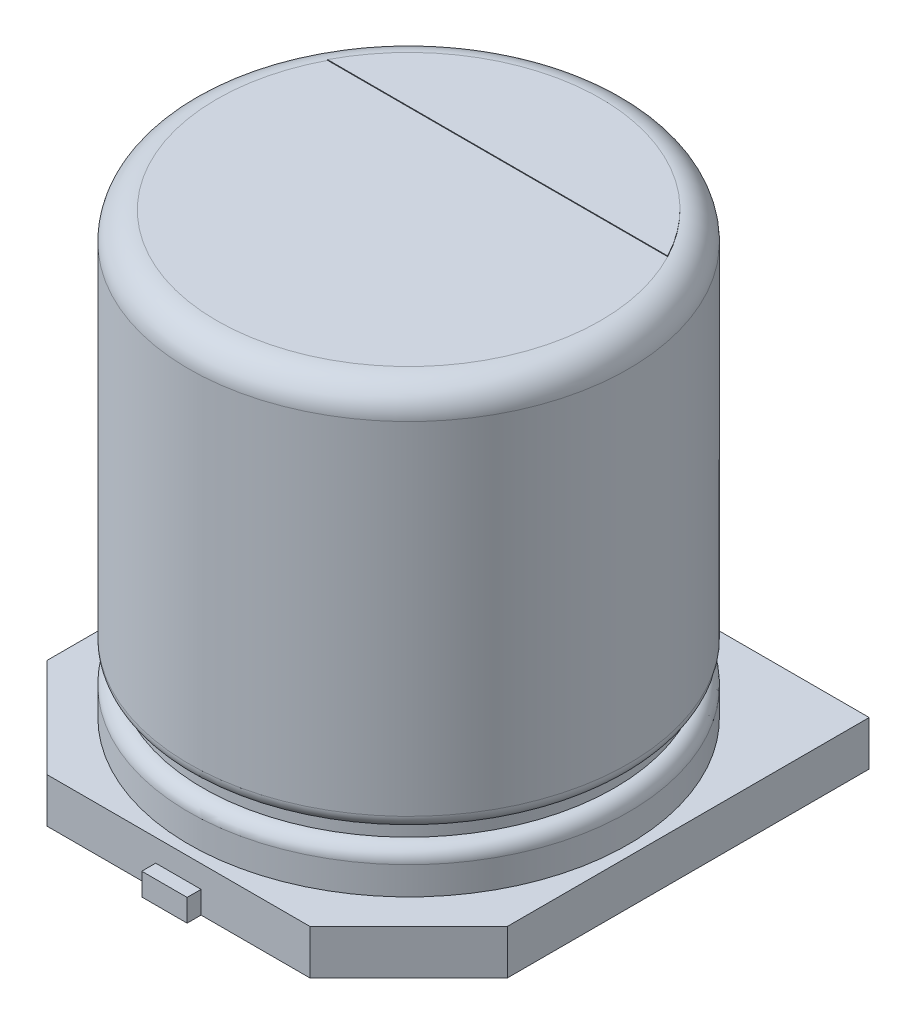
ISO-10303-21;
HEADER;
FILE_DESCRIPTION(('STEP AP214'),'2;1');
FILE_NAME('part.step','',(''),(''),'','','');
FILE_SCHEMA(('AUTOMOTIVE_DESIGN { 1 0 10303 214 1 1 1 1 }'));
ENDSEC;
DATA;
#1=APPLICATION_CONTEXT('core data for automotive mechanical design processes');
#2=APPLICATION_PROTOCOL_DEFINITION('international standard','automotive_design',2000,#1);
#3=PRODUCT_CONTEXT('',#1,'mechanical');
#4=PRODUCT('Part','Part','',(#3));
#5=PRODUCT_RELATED_PRODUCT_CATEGORY('part','',(#4));
#6=PRODUCT_DEFINITION_FORMATION('','',#4);
#7=PRODUCT_DEFINITION_CONTEXT('part definition',#1,'design');
#8=PRODUCT_DEFINITION('design','',#6,#7);
#9=PRODUCT_DEFINITION_SHAPE('','',#8);
#10=(LENGTH_UNIT() NAMED_UNIT(*) SI_UNIT(.MILLI.,.METRE.));
#11=(NAMED_UNIT(*) PLANE_ANGLE_UNIT() SI_UNIT($,.RADIAN.));
#12=(NAMED_UNIT(*) SI_UNIT($,.STERADIAN.) SOLID_ANGLE_UNIT());
#13=UNCERTAINTY_MEASURE_WITH_UNIT(LENGTH_MEASURE(1.E-05),#10,'distance_accuracy_value','');
#14=(GEOMETRIC_REPRESENTATION_CONTEXT(3) GLOBAL_UNCERTAINTY_ASSIGNED_CONTEXT((#13)) GLOBAL_UNIT_ASSIGNED_CONTEXT((#10,
#11,#12)) REPRESENTATION_CONTEXT('',''));
#15=CARTESIAN_POINT('',(0.,0.,0.));
#16=DIRECTION('',(0.,0.,1.));
#17=DIRECTION('',(1.,0.,0.));
#18=AXIS2_PLACEMENT_3D('',#15,#16,#17);
#19=CARTESIAN_POINT('',(-0.324999999999999,-0.64,-3.5));
#20=DIRECTION('',(0.,0.,1.));
#21=DIRECTION('',(0.,-1.,0.));
#22=AXIS2_PLACEMENT_3D('',#19,#20,#21);
#23=PLANE('',#22);
#24=DIRECTION('',(0.,1.,0.));
#25=VECTOR('',#24,1.);
#26=CARTESIAN_POINT('',(0.325,-0.64,-3.5));
#27=LINE('',#26,#25);
#28=CARTESIAN_POINT('',(0.325,-0.32,-3.5));
#29=VERTEX_POINT('',#28);
#30=CARTESIAN_POINT('',(0.325,-0.64,-3.5));
#31=VERTEX_POINT('',#30);
#32=EDGE_CURVE('E248',#29,#31,#27,.F.);
#33=ORIENTED_EDGE('',*,*,#32,.T.);
#34=DIRECTION('',(1.,0.,0.));
#35=VECTOR('',#34,1.);
#36=CARTESIAN_POINT('',(0.,-0.64,-3.5));
#37=LINE('',#36,#35);
#38=CARTESIAN_POINT('',(-0.324999999999999,-0.64,-3.5));
#39=VERTEX_POINT('',#38);
#40=EDGE_CURVE('E235',#39,#31,#37,.T.);
#41=ORIENTED_EDGE('',*,*,#40,.F.);
#42=DIRECTION('',(0.,1.,0.));
#43=VECTOR('',#42,1.);
#44=CARTESIAN_POINT('',(-0.325,-0.64,-3.5));
#45=LINE('',#44,#43);
#46=CARTESIAN_POINT('',(-0.324999999999999,-0.32,-3.5));
#47=VERTEX_POINT('',#46);
#48=EDGE_CURVE('E238',#39,#47,#45,.T.);
#49=ORIENTED_EDGE('',*,*,#48,.T.);
#50=DIRECTION('',(1.,0.,0.));
#51=VECTOR('',#50,1.);
#52=CARTESIAN_POINT('',(0.,-0.32,-3.5));
#53=LINE('',#52,#51);
#54=EDGE_CURVE('E243',#47,#29,#53,.T.);
#55=ORIENTED_EDGE('',*,*,#54,.T.);
#56=EDGE_LOOP('',(#33,#41,#49,#55));
#57=FACE_BOUND('',#56,.T.);
#58=ADVANCED_FACE('F17',(#57),#23,.F.);
#59=CARTESIAN_POINT('',(-0.324999999999999,-0.64,3.5));
#60=DIRECTION('',(0.,0.,-1.));
#61=DIRECTION('',(0.,1.,0.));
#62=AXIS2_PLACEMENT_3D('',#59,#60,#61);
#63=PLANE('',#62);
#64=DIRECTION('',(0.,1.,0.));
#65=VECTOR('',#64,1.);
#66=CARTESIAN_POINT('',(-0.325,-0.64,3.5));
#67=LINE('',#66,#65);
#68=CARTESIAN_POINT('',(-0.324999999999999,-0.32,3.5));
#69=VERTEX_POINT('',#68);
#70=CARTESIAN_POINT('',(-0.324999999999999,-0.64,3.5));
#71=VERTEX_POINT('',#70);
#72=EDGE_CURVE('E265',#69,#71,#67,.F.);
#73=ORIENTED_EDGE('',*,*,#72,.T.);
#74=DIRECTION('',(1.,0.,0.));
#75=VECTOR('',#74,1.);
#76=CARTESIAN_POINT('',(0.,-0.64,3.5));
#77=LINE('',#76,#75);
#78=CARTESIAN_POINT('',(0.325,-0.64,3.5));
#79=VERTEX_POINT('',#78);
#80=EDGE_CURVE('E232',#79,#71,#77,.F.);
#81=ORIENTED_EDGE('',*,*,#80,.F.);
#82=DIRECTION('',(0.,1.,0.));
#83=VECTOR('',#82,1.);
#84=CARTESIAN_POINT('',(0.325,-0.64,3.5));
#85=LINE('',#84,#83);
#86=CARTESIAN_POINT('',(0.325,-0.32,3.5));
#87=VERTEX_POINT('',#86);
#88=EDGE_CURVE('E255',#79,#87,#85,.T.);
#89=ORIENTED_EDGE('',*,*,#88,.T.);
#90=DIRECTION('',(1.,0.,0.));
#91=VECTOR('',#90,1.);
#92=CARTESIAN_POINT('',(0.,-0.32,3.5));
#93=LINE('',#92,#91);
#94=EDGE_CURVE('E260',#87,#69,#93,.F.);
#95=ORIENTED_EDGE('',*,*,#94,.T.);
#96=EDGE_LOOP('',(#73,#81,#89,#95));
#97=FACE_BOUND('',#96,.T.);
#98=ADVANCED_FACE('F557',(#97),#63,.F.);
#99=CARTESIAN_POINT('',(-0.325,-0.64,-0.9));
#100=DIRECTION('',(1.,0.,0.));
#101=DIRECTION('',(0.,0.,-1.));
#102=AXIS2_PLACEMENT_3D('',#99,#100,#101);
#103=PLANE('',#102);
#104=DIRECTION('',(0.,1.,0.));
#105=VECTOR('',#104,1.);
#106=CARTESIAN_POINT('',(-0.324999999999999,-0.64,-3.3));
#107=LINE('',#106,#105);
#108=CARTESIAN_POINT('',(-0.324999999999999,-0.64,-3.3));
#109=VERTEX_POINT('',#108);
#110=CARTESIAN_POINT('',(-0.324999999999999,-0.32,-3.3));
#111=VERTEX_POINT('',#110);
#112=EDGE_CURVE('E276',#109,#111,#107,.T.);
#113=ORIENTED_EDGE('',*,*,#112,.T.);
#114=DIRECTION('',(0.,0.,-1.));
#115=VECTOR('',#114,1.);
#116=CARTESIAN_POINT('',(-0.324999999999999,-0.32,0.));
#117=LINE('',#116,#115);
#118=EDGE_CURVE('E245',#111,#47,#117,.T.);
#119=ORIENTED_EDGE('',*,*,#118,.T.);
#120=ORIENTED_EDGE('',*,*,#48,.F.);
#121=DIRECTION('',(0.,0.,-1.));
#122=VECTOR('',#121,1.);
#123=CARTESIAN_POINT('',(-0.325,-0.64,-0.9));
#124=LINE('',#123,#122);
#125=EDGE_CURVE('E240',#109,#39,#124,.T.);
#126=ORIENTED_EDGE('',*,*,#125,.F.);
#127=EDGE_LOOP('',(#113,#119,#120,#126));
#128=FACE_BOUND('',#127,.T.);
#129=ADVANCED_FACE('F376',(#128),#103,.F.);
#130=CARTESIAN_POINT('',(0.,-0.32,0.));
#131=DIRECTION('',(0.,-1.,0.));
#132=DIRECTION('',(0.,0.,-1.));
#133=AXIS2_PLACEMENT_3D('',#130,#131,#132);
#134=PLANE('',#133);
#135=DIRECTION('',(1.,0.,0.));
#136=VECTOR('',#135,1.);
#137=CARTESIAN_POINT('',(-3.3,-0.32,-3.3));
#138=LINE('',#137,#136);
#139=CARTESIAN_POINT('',(0.325,-0.32,-3.3));
#140=VERTEX_POINT('',#139);
#141=EDGE_CURVE('E278',#111,#140,#138,.T.);
#142=ORIENTED_EDGE('',*,*,#141,.T.);
#143=DIRECTION('',(0.,0.,1.));
#144=VECTOR('',#143,1.);
#145=CARTESIAN_POINT('',(0.325,-0.32,-0.9));
#146=LINE('',#145,#144);
#147=EDGE_CURVE('E252',#140,#29,#146,.F.);
#148=ORIENTED_EDGE('',*,*,#147,.T.);
#149=ORIENTED_EDGE('',*,*,#54,.F.);
#150=ORIENTED_EDGE('',*,*,#118,.F.);
#151=EDGE_LOOP('',(#142,#148,#149,#150));
#152=FACE_BOUND('',#151,.T.);
#153=ADVANCED_FACE('F372',(#152),#134,.F.);
#154=CARTESIAN_POINT('',(0.325,-0.64,-0.9));
#155=DIRECTION('',(-1.,0.,0.));
#156=DIRECTION('',(0.,0.,1.));
#157=AXIS2_PLACEMENT_3D('',#154,#155,#156);
#158=PLANE('',#157);
#159=DIRECTION('',(0.,1.,0.));
#160=VECTOR('',#159,1.);
#161=CARTESIAN_POINT('',(0.325,-0.64,-3.3));
#162=LINE('',#161,#160);
#163=CARTESIAN_POINT('',(0.325,-0.64,-3.3));
#164=VERTEX_POINT('',#163);
#165=EDGE_CURVE('E280',#140,#164,#162,.F.);
#166=ORIENTED_EDGE('',*,*,#165,.T.);
#167=DIRECTION('',(0.,0.,1.));
#168=VECTOR('',#167,1.);
#169=CARTESIAN_POINT('',(0.325,-0.64,-0.9));
#170=LINE('',#169,#168);
#171=EDGE_CURVE('E250',#31,#164,#170,.T.);
#172=ORIENTED_EDGE('',*,*,#171,.F.);
#173=ORIENTED_EDGE('',*,*,#32,.F.);
#174=ORIENTED_EDGE('',*,*,#147,.F.);
#175=EDGE_LOOP('',(#166,#172,#173,#174));
#176=FACE_BOUND('',#175,.T.);
#177=ADVANCED_FACE('F368',(#176),#158,.F.);
#178=CARTESIAN_POINT('',(0.325,-0.64,0.9));
#179=DIRECTION('',(-1.,0.,0.));
#180=DIRECTION('',(0.,0.,1.));
#181=AXIS2_PLACEMENT_3D('',#178,#179,#180);
#182=PLANE('',#181);
#183=DIRECTION('',(0.,1.,0.));
#184=VECTOR('',#183,1.);
#185=CARTESIAN_POINT('',(0.325,-0.64,3.3));
#186=LINE('',#185,#184);
#187=CARTESIAN_POINT('',(0.325,-0.64,3.3));
#188=VERTEX_POINT('',#187);
#189=CARTESIAN_POINT('',(0.325,-0.32,3.3));
#190=VERTEX_POINT('',#189);
#191=EDGE_CURVE('E300',#188,#190,#186,.T.);
#192=ORIENTED_EDGE('',*,*,#191,.T.);
#193=DIRECTION('',(0.,0.,-1.));
#194=VECTOR('',#193,1.);
#195=CARTESIAN_POINT('',(0.325,-0.32,0.));
#196=LINE('',#195,#194);
#197=EDGE_CURVE('E262',#190,#87,#196,.F.);
#198=ORIENTED_EDGE('',*,*,#197,.T.);
#199=ORIENTED_EDGE('',*,*,#88,.F.);
#200=DIRECTION('',(0.,0.,1.));
#201=VECTOR('',#200,1.);
#202=CARTESIAN_POINT('',(0.325,-0.64,0.9));
#203=LINE('',#202,#201);
#204=EDGE_CURVE('E257',#188,#79,#203,.T.);
#205=ORIENTED_EDGE('',*,*,#204,.F.);
#206=EDGE_LOOP('',(#192,#198,#199,#205));
#207=FACE_BOUND('',#206,.T.);
#208=ADVANCED_FACE('F522',(#207),#182,.F.);
#209=CARTESIAN_POINT('',(0.,-0.32,0.));
#210=DIRECTION('',(0.,-1.,0.));
#211=DIRECTION('',(0.,0.,-1.));
#212=AXIS2_PLACEMENT_3D('',#209,#210,#211);
#213=PLANE('',#212);
#214=DIRECTION('',(-1.,0.,0.));
#215=VECTOR('',#214,1.);
#216=CARTESIAN_POINT('',(1.88578643762691,-0.32,3.3));
#217=LINE('',#216,#215);
#218=CARTESIAN_POINT('',(-0.324999999999999,-0.32,3.3));
#219=VERTEX_POINT('',#218);
#220=EDGE_CURVE('E302',#190,#219,#217,.T.);
#221=ORIENTED_EDGE('',*,*,#220,.T.);
#222=DIRECTION('',(0.,0.,-1.));
#223=VECTOR('',#222,1.);
#224=CARTESIAN_POINT('',(-0.325,-0.32,0.9));
#225=LINE('',#224,#223);
#226=EDGE_CURVE('E269',#219,#69,#225,.F.);
#227=ORIENTED_EDGE('',*,*,#226,.T.);
#228=ORIENTED_EDGE('',*,*,#94,.F.);
#229=ORIENTED_EDGE('',*,*,#197,.F.);
#230=EDGE_LOOP('',(#221,#227,#228,#229));
#231=FACE_BOUND('',#230,.T.);
#232=ADVANCED_FACE('F512',(#231),#213,.F.);
#233=CARTESIAN_POINT('',(-0.325,-0.64,0.9));
#234=DIRECTION('',(1.,0.,0.));
#235=DIRECTION('',(0.,0.,-1.));
#236=AXIS2_PLACEMENT_3D('',#233,#234,#235);
#237=PLANE('',#236);
#238=DIRECTION('',(0.,1.,0.));
#239=VECTOR('',#238,1.);
#240=CARTESIAN_POINT('',(-0.324999999999999,-0.64,3.3));
#241=LINE('',#240,#239);
#242=CARTESIAN_POINT('',(-0.324999999999999,-0.64,3.3));
#243=VERTEX_POINT('',#242);
#244=EDGE_CURVE('E304',#219,#243,#241,.F.);
#245=ORIENTED_EDGE('',*,*,#244,.T.);
#246=DIRECTION('',(0.,0.,-1.));
#247=VECTOR('',#246,1.);
#248=CARTESIAN_POINT('',(-0.325,-0.64,0.9));
#249=LINE('',#248,#247);
#250=EDGE_CURVE('E267',#71,#243,#249,.T.);
#251=ORIENTED_EDGE('',*,*,#250,.F.);
#252=ORIENTED_EDGE('',*,*,#72,.F.);
#253=ORIENTED_EDGE('',*,*,#226,.F.);
#254=EDGE_LOOP('',(#245,#251,#252,#253));
#255=FACE_BOUND('',#254,.T.);
#256=ADVANCED_FACE('F503',(#255),#237,.F.);
#257=CARTESIAN_POINT('',(0.,-0.64,0.));
#258=DIRECTION('',(0.,-1.,0.));
#259=DIRECTION('',(1.,0.,0.));
#260=AXIS2_PLACEMENT_3D('',#257,#258,#259);
#261=PLANE('',#260);
#262=DIRECTION('',(0.,0.,1.));
#263=VECTOR('',#262,1.);
#264=CARTESIAN_POINT('',(3.3,-0.64,-3.3));
#265=LINE('',#264,#263);
#266=CARTESIAN_POINT('',(3.3,-0.64,-3.3));
#267=VERTEX_POINT('',#266);
#268=CARTESIAN_POINT('',(3.3,-0.64,1.8857864376269));
#269=VERTEX_POINT('',#268);
#270=EDGE_CURVE('E286',#267,#269,#265,.T.);
#271=ORIENTED_EDGE('',*,*,#270,.T.);
#272=DIRECTION('',(-0.707106781186546,0.,0.707106781186549));
#273=VECTOR('',#272,1.);
#274=CARTESIAN_POINT('',(3.3,-0.64,1.8857864376269));
#275=LINE('',#274,#273);
#276=CARTESIAN_POINT('',(1.88578643762691,-0.64,3.3));
#277=VERTEX_POINT('',#276);
#278=EDGE_CURVE('E291',#269,#277,#275,.T.);
#279=ORIENTED_EDGE('',*,*,#278,.T.);
#280=DIRECTION('',(-1.,0.,0.));
#281=VECTOR('',#280,1.);
#282=CARTESIAN_POINT('',(1.88578643762691,-0.64,3.3));
#283=LINE('',#282,#281);
#284=EDGE_CURVE('E298',#277,#188,#283,.T.);
#285=ORIENTED_EDGE('',*,*,#284,.T.);
#286=ORIENTED_EDGE('',*,*,#204,.T.);
#287=ORIENTED_EDGE('',*,*,#80,.T.);
#288=ORIENTED_EDGE('',*,*,#250,.T.);
#289=DIRECTION('',(-1.,0.,0.));
#290=VECTOR('',#289,1.);
#291=CARTESIAN_POINT('',(1.88578643762691,-0.64,3.3));
#292=LINE('',#291,#290);
#293=CARTESIAN_POINT('',(-1.88578643762691,-0.64,3.3));
#294=VERTEX_POINT('',#293);
#295=EDGE_CURVE('E293',#243,#294,#292,.T.);
#296=ORIENTED_EDGE('',*,*,#295,.T.);
#297=DIRECTION('',(-0.707106781186546,0.,-0.707106781186549));
#298=VECTOR('',#297,1.);
#299=CARTESIAN_POINT('',(-1.88578643762691,-0.64,3.3));
#300=LINE('',#299,#298);
#301=CARTESIAN_POINT('',(-3.3,-0.64,1.8857864376269));
#302=VERTEX_POINT('',#301);
#303=EDGE_CURVE('E310',#294,#302,#300,.T.);
#304=ORIENTED_EDGE('',*,*,#303,.T.);
#305=DIRECTION('',(0.,0.,1.));
#306=VECTOR('',#305,1.);
#307=CARTESIAN_POINT('',(-3.3,-0.64,1.8857864376269));
#308=LINE('',#307,#306);
#309=CARTESIAN_POINT('',(-3.3,-0.64,-3.3));
#310=VERTEX_POINT('',#309);
#311=EDGE_CURVE('E315',#302,#310,#308,.F.);
#312=ORIENTED_EDGE('',*,*,#311,.T.);
#313=DIRECTION('',(1.,0.,0.));
#314=VECTOR('',#313,1.);
#315=CARTESIAN_POINT('',(-3.3,-0.64,-3.3));
#316=LINE('',#315,#314);
#317=EDGE_CURVE('E274',#310,#109,#316,.T.);
#318=ORIENTED_EDGE('',*,*,#317,.T.);
#319=ORIENTED_EDGE('',*,*,#125,.T.);
#320=ORIENTED_EDGE('',*,*,#40,.T.);
#321=ORIENTED_EDGE('',*,*,#171,.T.);
#322=DIRECTION('',(1.,0.,0.));
#323=VECTOR('',#322,1.);
#324=CARTESIAN_POINT('',(-3.3,-0.64,-3.3));
#325=LINE('',#324,#323);
#326=EDGE_CURVE('E272',#164,#267,#325,.T.);
#327=ORIENTED_EDGE('',*,*,#326,.T.);
#328=EDGE_LOOP('',(#271,#279,#285,#286,#287,#288,#296,#304,#312,#318,#319,#320,#321,#327));
#329=FACE_BOUND('',#328,.T.);
#330=ADVANCED_FACE('F362',(#329),#261,.T.);
#331=CARTESIAN_POINT('',(-3.3,-0.64,-3.3));
#332=DIRECTION('',(0.,0.,1.));
#333=DIRECTION('',(1.,0.,0.));
#334=AXIS2_PLACEMENT_3D('',#331,#332,#333);
#335=PLANE('',#334);
#336=ORIENTED_EDGE('',*,*,#141,.F.);
#337=ORIENTED_EDGE('',*,*,#112,.F.);
#338=ORIENTED_EDGE('',*,*,#317,.F.);
#339=DIRECTION('',(0.,1.,0.));
#340=VECTOR('',#339,1.);
#341=CARTESIAN_POINT('',(-3.3,-0.64,-3.3));
#342=LINE('',#341,#340);
#343=CARTESIAN_POINT('',(-3.3,0.,-3.3));
#344=VERTEX_POINT('',#343);
#345=EDGE_CURVE('E317',#310,#344,#342,.T.);
#346=ORIENTED_EDGE('',*,*,#345,.T.);
#347=DIRECTION('',(1.,0.,0.));
#348=VECTOR('',#347,1.);
#349=CARTESIAN_POINT('',(0.,0.,-3.3));
#350=LINE('',#349,#348);
#351=CARTESIAN_POINT('',(3.3,0.,-3.3));
#352=VERTEX_POINT('',#351);
#353=EDGE_CURVE('E319',#344,#352,#350,.T.);
#354=ORIENTED_EDGE('',*,*,#353,.T.);
#355=DIRECTION('',(0.,-1.,0.));
#356=VECTOR('',#355,1.);
#357=CARTESIAN_POINT('',(3.3,-0.64,-3.3));
#358=LINE('',#357,#356);
#359=EDGE_CURVE('E283',#352,#267,#358,.T.);
#360=ORIENTED_EDGE('',*,*,#359,.T.);
#361=ORIENTED_EDGE('',*,*,#326,.F.);
#362=ORIENTED_EDGE('',*,*,#165,.F.);
#363=EDGE_LOOP('',(#336,#337,#338,#346,#354,#360,#361,#362));
#364=FACE_BOUND('',#363,.T.);
#365=ADVANCED_FACE('F353',(#364),#335,.F.);
#366=CARTESIAN_POINT('',(3.3,-0.64,-3.3));
#367=DIRECTION('',(-1.,0.,0.));
#368=DIRECTION('',(0.,-1.,0.));
#369=AXIS2_PLACEMENT_3D('',#366,#367,#368);
#370=PLANE('',#369);
#371=DIRECTION('',(0.,1.,0.));
#372=VECTOR('',#371,1.);
#373=CARTESIAN_POINT('',(3.3,-0.64,1.8857864376269));
#374=LINE('',#373,#372);
#375=CARTESIAN_POINT('',(3.3,0.,1.8857864376269));
#376=VERTEX_POINT('',#375);
#377=EDGE_CURVE('E288',#376,#269,#374,.F.);
#378=ORIENTED_EDGE('',*,*,#377,.T.);
#379=ORIENTED_EDGE('',*,*,#270,.F.);
#380=ORIENTED_EDGE('',*,*,#359,.F.);
#381=DIRECTION('',(0.,0.,1.));
#382=VECTOR('',#381,1.);
#383=CARTESIAN_POINT('',(3.3,0.,0.));
#384=LINE('',#383,#382);
#385=EDGE_CURVE('E321',#352,#376,#384,.T.);
#386=ORIENTED_EDGE('',*,*,#385,.T.);
#387=EDGE_LOOP('',(#378,#379,#380,#386));
#388=FACE_BOUND('',#387,.T.);
#389=ADVANCED_FACE('F358',(#388),#370,.F.);
#390=CARTESIAN_POINT('',(3.3,-0.64,1.8857864376269));
#391=DIRECTION('',(-0.707106781186549,0.,-0.707106781186546));
#392=DIRECTION('',(-0.707106781186546,0.,0.707106781186549));
#393=AXIS2_PLACEMENT_3D('',#390,#391,#392);
#394=PLANE('',#393);
#395=DIRECTION('',(0.,1.,0.));
#396=VECTOR('',#395,1.);
#397=CARTESIAN_POINT('',(1.88578643762691,-0.64,3.3));
#398=LINE('',#397,#396);
#399=CARTESIAN_POINT('',(1.88578643762691,0.,3.3));
#400=VERTEX_POINT('',#399);
#401=EDGE_CURVE('E295',#400,#277,#398,.F.);
#402=ORIENTED_EDGE('',*,*,#401,.T.);
#403=ORIENTED_EDGE('',*,*,#278,.F.);
#404=ORIENTED_EDGE('',*,*,#377,.F.);
#405=DIRECTION('',(-0.707106781186545,0.,0.70710678118655));
#406=VECTOR('',#405,1.);
#407=CARTESIAN_POINT('',(3.3,0.,1.8857864376269));
#408=LINE('',#407,#406);
#409=EDGE_CURVE('E323',#376,#400,#408,.T.);
#410=ORIENTED_EDGE('',*,*,#409,.T.);
#411=EDGE_LOOP('',(#402,#403,#404,#410));
#412=FACE_BOUND('',#411,.T.);
#413=ADVANCED_FACE('F391',(#412),#394,.F.);
#414=CARTESIAN_POINT('',(1.88578643762691,-0.64,3.3));
#415=DIRECTION('',(0.,0.,-1.));
#416=DIRECTION('',(-1.,0.,0.));
#417=AXIS2_PLACEMENT_3D('',#414,#415,#416);
#418=PLANE('',#417);
#419=ORIENTED_EDGE('',*,*,#220,.F.);
#420=ORIENTED_EDGE('',*,*,#191,.F.);
#421=ORIENTED_EDGE('',*,*,#284,.F.);
#422=ORIENTED_EDGE('',*,*,#401,.F.);
#423=DIRECTION('',(1.,0.,0.));
#424=VECTOR('',#423,1.);
#425=CARTESIAN_POINT('',(0.,0.,3.3));
#426=LINE('',#425,#424);
#427=CARTESIAN_POINT('',(-1.88578643762691,0.,3.3));
#428=VERTEX_POINT('',#427);
#429=EDGE_CURVE('E325',#400,#428,#426,.F.);
#430=ORIENTED_EDGE('',*,*,#429,.T.);
#431=DIRECTION('',(0.,1.,0.));
#432=VECTOR('',#431,1.);
#433=CARTESIAN_POINT('',(-1.88578643762691,-0.64,3.3));
#434=LINE('',#433,#432);
#435=EDGE_CURVE('E307',#428,#294,#434,.F.);
#436=ORIENTED_EDGE('',*,*,#435,.T.);
#437=ORIENTED_EDGE('',*,*,#295,.F.);
#438=ORIENTED_EDGE('',*,*,#244,.F.);
#439=EDGE_LOOP('',(#419,#420,#421,#422,#430,#436,#437,#438));
#440=FACE_BOUND('',#439,.T.);
#441=ADVANCED_FACE('F383',(#440),#418,.F.);
#442=CARTESIAN_POINT('',(-1.88578643762691,-0.64,3.3));
#443=DIRECTION('',(0.707106781186549,0.,-0.707106781186546));
#444=DIRECTION('',(-0.707106781186546,0.,-0.707106781186549));
#445=AXIS2_PLACEMENT_3D('',#442,#443,#444);
#446=PLANE('',#445);
#447=DIRECTION('',(0.,1.,0.));
#448=VECTOR('',#447,1.);
#449=CARTESIAN_POINT('',(-3.3,-0.64,1.8857864376269));
#450=LINE('',#449,#448);
#451=CARTESIAN_POINT('',(-3.3,0.,1.8857864376269));
#452=VERTEX_POINT('',#451);
#453=EDGE_CURVE('E312',#452,#302,#450,.F.);
#454=ORIENTED_EDGE('',*,*,#453,.T.);
#455=ORIENTED_EDGE('',*,*,#303,.F.);
#456=ORIENTED_EDGE('',*,*,#435,.F.);
#457=DIRECTION('',(-0.707106781186545,0.,-0.70710678118655));
#458=VECTOR('',#457,1.);
#459=CARTESIAN_POINT('',(-1.88578643762691,0.,3.3));
#460=LINE('',#459,#458);
#461=EDGE_CURVE('E326',#428,#452,#460,.T.);
#462=ORIENTED_EDGE('',*,*,#461,.T.);
#463=EDGE_LOOP('',(#454,#455,#456,#462));
#464=FACE_BOUND('',#463,.T.);
#465=ADVANCED_FACE('F381',(#464),#446,.F.);
#466=CARTESIAN_POINT('',(-3.3,-0.64,1.8857864376269));
#467=DIRECTION('',(1.,0.,0.));
#468=DIRECTION('',(0.,1.,0.));
#469=AXIS2_PLACEMENT_3D('',#466,#467,#468);
#470=PLANE('',#469);
#471=ORIENTED_EDGE('',*,*,#345,.F.);
#472=ORIENTED_EDGE('',*,*,#311,.F.);
#473=ORIENTED_EDGE('',*,*,#453,.F.);
#474=DIRECTION('',(0.,0.,1.));
#475=VECTOR('',#474,1.);
#476=CARTESIAN_POINT('',(-3.3,0.,0.));
#477=LINE('',#476,#475);
#478=EDGE_CURVE('E203',#452,#344,#477,.F.);
#479=ORIENTED_EDGE('',*,*,#478,.T.);
#480=EDGE_LOOP('',(#471,#472,#473,#479));
#481=FACE_BOUND('',#480,.T.);
#482=ADVANCED_FACE('F345',(#481),#470,.F.);
#483=CARTESIAN_POINT('',(0.,0.,0.));
#484=DIRECTION('',(0.,-1.,0.));
#485=DIRECTION('',(1.,0.,0.));
#486=AXIS2_PLACEMENT_3D('',#483,#484,#485);
#487=PLANE('',#486);
#488=CARTESIAN_POINT('',(0.,0.,0.));
#489=DIRECTION('',(0.,1.,0.));
#490=DIRECTION('',(-1.,0.,0.));
#491=AXIS2_PLACEMENT_3D('',#488,#489,#490);
#492=CIRCLE('',#491,3.15);
#493=CARTESIAN_POINT('',(-3.15,0.,0.));
#494=VERTEX_POINT('',#493);
#495=EDGE_CURVE('E20',#494,#494,#492,.T.);
#496=ORIENTED_EDGE('',*,*,#495,.F.);
#497=EDGE_LOOP('',(#496));
#498=FACE_BOUND('',#497,.T.);
#499=ORIENTED_EDGE('',*,*,#461,.F.);
#500=ORIENTED_EDGE('',*,*,#429,.F.);
#501=ORIENTED_EDGE('',*,*,#409,.F.);
#502=ORIENTED_EDGE('',*,*,#385,.F.);
#503=ORIENTED_EDGE('',*,*,#353,.F.);
#504=ORIENTED_EDGE('',*,*,#478,.F.);
#505=EDGE_LOOP('',(#499,#500,#501,#502,#503,#504));
#506=FACE_BOUND('',#505,.T.);
#507=ADVANCED_FACE('F342',(#498,#506),#487,.F.);
#508=CARTESIAN_POINT('',(0.,8.08222988146831,0.));
#509=DIRECTION('',(0.,1.,0.));
#510=DIRECTION('',(-1.,0.,0.));
#511=AXIS2_PLACEMENT_3D('',#508,#509,#510);
#512=CYLINDRICAL_SURFACE('',#511,3.15);
#513=ORIENTED_EDGE('',*,*,#495,.T.);
#514=EDGE_LOOP('',(#513));
#515=FACE_BOUND('',#514,.T.);
#516=CARTESIAN_POINT('',(0.,0.4,0.));
#517=DIRECTION('',(0.,1.,0.));
#518=DIRECTION('',(-1.,0.,0.));
#519=AXIS2_PLACEMENT_3D('',#516,#517,#518);
#520=CIRCLE('',#519,3.15);
#521=CARTESIAN_POINT('',(-3.15,0.4,0.));
#522=VERTEX_POINT('',#521);
#523=EDGE_CURVE('E158',#522,#522,#520,.T.);
#524=ORIENTED_EDGE('',*,*,#523,.F.);
#525=EDGE_LOOP('',(#524));
#526=FACE_BOUND('',#525,.T.);
#527=ADVANCED_FACE('F339',(#515,#526),#512,.T.);
#528=CARTESIAN_POINT('',(-2.43657033553312,6.31,-1.275));
#529=DIRECTION('',(0.,0.,-1.));
#530=DIRECTION('',(-1.,0.,0.));
#531=AXIS2_PLACEMENT_3D('',#528,#529,#530);
#532=PLANE('',#531);
#533=DIRECTION('',(0.,1.,0.));
#534=VECTOR('',#533,1.);
#535=CARTESIAN_POINT('',(2.43657033553312,6.31,-1.275));
#536=LINE('',#535,#534);
#537=CARTESIAN_POINT('',(2.43657033553312,6.31,-1.275));
#538=VERTEX_POINT('',#537);
#539=CARTESIAN_POINT('',(2.43657033553312,6.3,-1.275));
#540=VERTEX_POINT('',#539);
#541=EDGE_CURVE('E131',#538,#540,#536,.F.);
#542=ORIENTED_EDGE('',*,*,#541,.F.);
#543=DIRECTION('',(-1.,0.,0.));
#544=VECTOR('',#543,1.);
#545=CARTESIAN_POINT('',(0.,6.31,-1.275));
#546=LINE('',#545,#544);
#547=CARTESIAN_POINT('',(-2.43657033553312,6.31,-1.275));
#548=VERTEX_POINT('',#547);
#549=EDGE_CURVE('E139',#548,#538,#546,.F.);
#550=ORIENTED_EDGE('',*,*,#549,.F.);
#551=DIRECTION('',(0.,1.,0.));
#552=VECTOR('',#551,1.);
#553=CARTESIAN_POINT('',(-2.43657033553312,6.31,-1.275));
#554=LINE('',#553,#552);
#555=CARTESIAN_POINT('',(-2.43657033553312,6.3,-1.275));
#556=VERTEX_POINT('',#555);
#557=EDGE_CURVE('E35',#556,#548,#554,.T.);
#558=ORIENTED_EDGE('',*,*,#557,.F.);
#559=DIRECTION('',(-1.,0.,0.));
#560=VECTOR('',#559,1.);
#561=CARTESIAN_POINT('',(0.,6.3,-1.275));
#562=LINE('',#561,#560);
#563=EDGE_CURVE('E151',#540,#556,#562,.T.);
#564=ORIENTED_EDGE('',*,*,#563,.F.);
#565=EDGE_LOOP('',(#542,#550,#558,#564));
#566=FACE_BOUND('',#565,.T.);
#567=ADVANCED_FACE('F152',(#566),#532,.F.);
#568=CARTESIAN_POINT('',(0.,6.31,0.));
#569=DIRECTION('',(0.,1.,0.));
#570=DIRECTION('',(-1.,0.,0.));
#571=AXIS2_PLACEMENT_3D('',#568,#569,#570);
#572=PLANE('',#571);
#573=CARTESIAN_POINT('',(0.,6.31,0.));
#574=DIRECTION('',(0.,-1.,0.));
#575=DIRECTION('',(1.,0.,0.));
#576=AXIS2_PLACEMENT_3D('',#573,#574,#575);
#577=CIRCLE('',#576,2.75);
#578=EDGE_CURVE('E137',#548,#538,#577,.T.);
#579=ORIENTED_EDGE('',*,*,#578,.F.);
#580=ORIENTED_EDGE('',*,*,#549,.T.);
#581=EDGE_LOOP('',(#579,#580));
#582=FACE_BOUND('',#581,.T.);
#583=ADVANCED_FACE('F182',(#582),#572,.T.);
#584=CARTESIAN_POINT('',(0.,0.4,0.));
#585=DIRECTION('',(0.,1.,0.));
#586=DIRECTION('',(-1.,0.,0.));
#587=AXIS2_PLACEMENT_3D('',#584,#585,#586);
#588=TOROIDAL_SURFACE('',#587,2.95,0.2);
#589=ORIENTED_EDGE('',*,*,#523,.T.);
#590=EDGE_LOOP('',(#589));
#591=FACE_BOUND('',#590,.T.);
#592=CARTESIAN_POINT('',(0.,0.6,0.));
#593=DIRECTION('',(0.,1.,0.));
#594=DIRECTION('',(-1.,0.,0.));
#595=AXIS2_PLACEMENT_3D('',#592,#593,#594);
#596=CIRCLE('',#595,2.95);
#597=CARTESIAN_POINT('',(-2.95,0.6,0.));
#598=VERTEX_POINT('',#597);
#599=EDGE_CURVE('E225',#598,#598,#596,.T.);
#600=ORIENTED_EDGE('',*,*,#599,.F.);
#601=EDGE_LOOP('',(#600));
#602=FACE_BOUND('',#601,.T.);
#603=ADVANCED_FACE('F176',(#591,#602),#588,.T.);
#604=CARTESIAN_POINT('',(0.,6.3,0.));
#605=DIRECTION('',(0.,1.,0.));
#606=DIRECTION('',(-1.,0.,0.));
#607=AXIS2_PLACEMENT_3D('',#604,#605,#606);
#608=PLANE('',#607);
#609=CARTESIAN_POINT('',(0.,6.3,0.));
#610=DIRECTION('',(0.,-1.,0.));
#611=DIRECTION('',(0.8860255765575,0.,-0.463636363636364));
#612=AXIS2_PLACEMENT_3D('',#609,#610,#611);
#613=CIRCLE('',#612,2.75);
#614=CARTESIAN_POINT('',(2.75,6.3,0.));
#615=VERTEX_POINT('',#614);
#616=EDGE_CURVE('E144',#615,#540,#613,.F.);
#617=ORIENTED_EDGE('',*,*,#616,.T.);
#618=ORIENTED_EDGE('',*,*,#563,.T.);
#619=CARTESIAN_POINT('',(0.,6.3,0.));
#620=DIRECTION('',(0.,-1.,0.));
#621=DIRECTION('',(1.,0.,0.));
#622=AXIS2_PLACEMENT_3D('',#619,#620,#621);
#623=CIRCLE('',#622,2.75);
#624=EDGE_CURVE('E147',#615,#556,#623,.T.);
#625=ORIENTED_EDGE('',*,*,#624,.F.);
#626=EDGE_LOOP('',(#617,#618,#625));
#627=FACE_BOUND('',#626,.T.);
#628=ADVANCED_FACE('F156',(#627),#608,.T.);
#629=CARTESIAN_POINT('',(0.,6.31,0.));
#630=DIRECTION('',(0.,-1.,0.));
#631=DIRECTION('',(1.,0.,0.));
#632=AXIS2_PLACEMENT_3D('',#629,#630,#631);
#633=CYLINDRICAL_SURFACE('',#632,2.75);
#634=ORIENTED_EDGE('',*,*,#578,.T.);
#635=ORIENTED_EDGE('',*,*,#541,.T.);
#636=CARTESIAN_POINT('',(0.,6.3,0.));
#637=DIRECTION('',(0.,1.,0.));
#638=DIRECTION('',(-1.,0.,0.));
#639=AXIS2_PLACEMENT_3D('',#636,#637,#638);
#640=CIRCLE('',#639,2.75);
#641=EDGE_CURVE('E134',#556,#540,#640,.F.);
#642=ORIENTED_EDGE('',*,*,#641,.F.);
#643=ORIENTED_EDGE('',*,*,#557,.T.);
#644=EDGE_LOOP('',(#634,#635,#642,#643));
#645=FACE_BOUND('',#644,.T.);
#646=ADVANCED_FACE('F133',(#645),#633,.T.);
#647=CARTESIAN_POINT('',(0.,8.08222988146831,0.));
#648=DIRECTION('',(0.,1.,0.));
#649=DIRECTION('',(-1.,0.,0.));
#650=AXIS2_PLACEMENT_3D('',#647,#648,#649);
#651=CYLINDRICAL_SURFACE('',#650,2.95);
#652=ORIENTED_EDGE('',*,*,#599,.T.);
#653=EDGE_LOOP('',(#652));
#654=FACE_BOUND('',#653,.T.);
#655=CARTESIAN_POINT('',(0.,0.8,0.));
#656=DIRECTION('',(0.,1.,0.));
#657=DIRECTION('',(-1.,0.,0.));
#658=AXIS2_PLACEMENT_3D('',#655,#656,#657);
#659=CIRCLE('',#658,2.95);
#660=CARTESIAN_POINT('',(-2.95,0.8,0.));
#661=VERTEX_POINT('',#660);
#662=EDGE_CURVE('E149',#661,#661,#659,.T.);
#663=ORIENTED_EDGE('',*,*,#662,.F.);
#664=EDGE_LOOP('',(#663));
#665=FACE_BOUND('',#664,.T.);
#666=ADVANCED_FACE('F215',(#654,#665),#651,.T.);
#667=CARTESIAN_POINT('',(0.,5.9,0.));
#668=DIRECTION('',(0.,1.,0.));
#669=DIRECTION('',(-1.,0.,0.));
#670=AXIS2_PLACEMENT_3D('',#667,#668,#669);
#671=TOROIDAL_SURFACE('',#670,2.75,0.400000000000001);
#672=CARTESIAN_POINT('',(0.,5.9,0.));
#673=DIRECTION('',(0.,1.,0.));
#674=DIRECTION('',(-1.,0.,0.));
#675=AXIS2_PLACEMENT_3D('',#672,#673,#674);
#676=CIRCLE('',#675,3.15);
#677=CARTESIAN_POINT('',(-3.15,5.9,0.));
#678=VERTEX_POINT('',#677);
#679=EDGE_CURVE('E26',#678,#678,#676,.F.);
#680=ORIENTED_EDGE('',*,*,#679,.F.);
#681=EDGE_LOOP('',(#680));
#682=FACE_BOUND('',#681,.T.);
#683=ORIENTED_EDGE('',*,*,#616,.F.);
#684=ORIENTED_EDGE('',*,*,#624,.T.);
#685=ORIENTED_EDGE('',*,*,#641,.T.);
#686=EDGE_LOOP('',(#683,#684,#685));
#687=FACE_BOUND('',#686,.T.);
#688=ADVANCED_FACE('F142',(#682,#687),#671,.T.);
#689=CARTESIAN_POINT('',(0.,1.,0.));
#690=DIRECTION('',(0.,1.,0.));
#691=DIRECTION('',(-1.,0.,0.));
#692=AXIS2_PLACEMENT_3D('',#689,#690,#691);
#693=TOROIDAL_SURFACE('',#692,2.95,0.2);
#694=ORIENTED_EDGE('',*,*,#662,.T.);
#695=EDGE_LOOP('',(#694));
#696=FACE_BOUND('',#695,.T.);
#697=CARTESIAN_POINT('',(0.,1.,0.));
#698=DIRECTION('',(0.,1.,0.));
#699=DIRECTION('',(-1.,0.,0.));
#700=AXIS2_PLACEMENT_3D('',#697,#698,#699);
#701=CIRCLE('',#700,3.15);
#702=CARTESIAN_POINT('',(-3.15,1.,0.));
#703=VERTEX_POINT('',#702);
#704=EDGE_CURVE('E11',#703,#703,#701,.T.);
#705=ORIENTED_EDGE('',*,*,#704,.F.);
#706=EDGE_LOOP('',(#705));
#707=FACE_BOUND('',#706,.T.);
#708=ADVANCED_FACE('F214',(#696,#707),#693,.T.);
#709=CARTESIAN_POINT('',(0.,8.08222988146831,0.));
#710=DIRECTION('',(0.,1.,0.));
#711=DIRECTION('',(-1.,0.,0.));
#712=AXIS2_PLACEMENT_3D('',#709,#710,#711);
#713=CYLINDRICAL_SURFACE('',#712,3.15);
#714=ORIENTED_EDGE('',*,*,#704,.T.);
#715=EDGE_LOOP('',(#714));
#716=FACE_BOUND('',#715,.T.);
#717=ORIENTED_EDGE('',*,*,#679,.T.);
#718=EDGE_LOOP('',(#717));
#719=FACE_BOUND('',#718,.T.);
#720=ADVANCED_FACE('F394',(#716,#719),#713,.T.);
#721=CLOSED_SHELL('',(#58,#98,#129,#153,#177,#208,#232,#256,#330,#365,#389,#413,#441,#465,#482,
#507,#527,#567,#583,#603,#628,#646,#666,#688,#708,#720));
#722=MANIFOLD_SOLID_BREP('B1',#721);
#723=ADVANCED_BREP_SHAPE_REPRESENTATION('',(#18,#722),#14);
#724=SHAPE_DEFINITION_REPRESENTATION(#9,#723);
ENDSEC;
END-ISO-10303-21;
